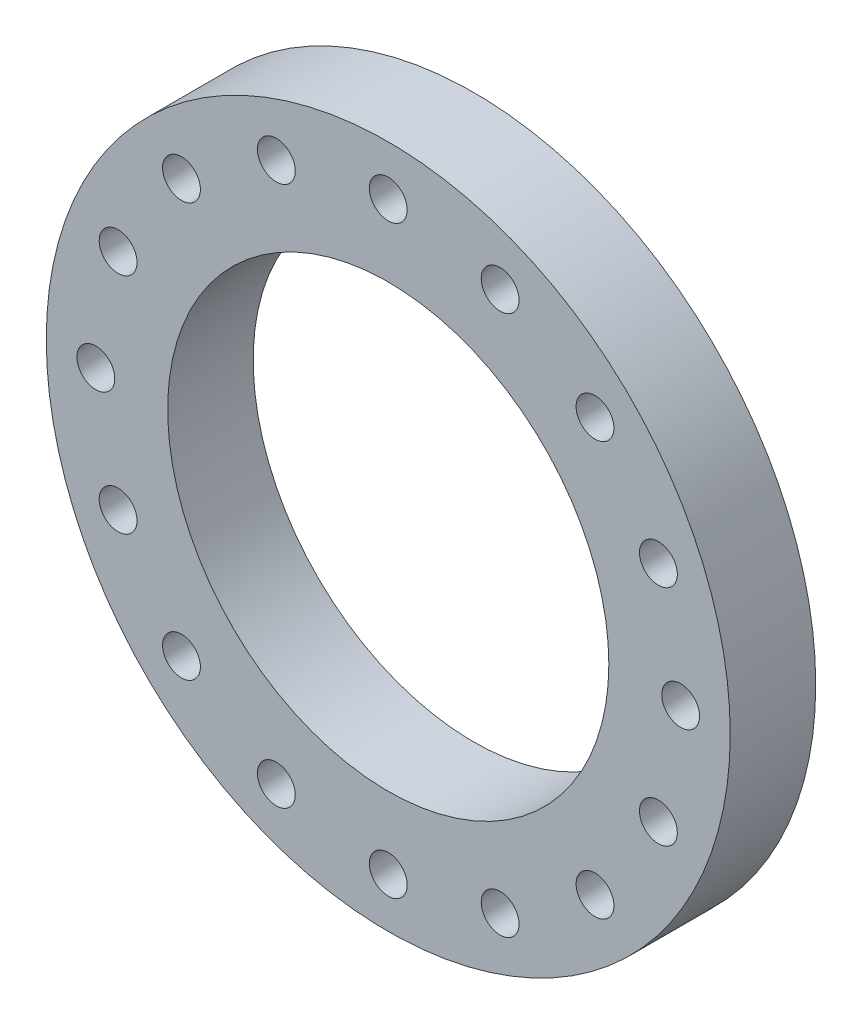
ISO-10303-21;
HEADER;
FILE_DESCRIPTION(('STEP AP214'),'2;1');
FILE_NAME('part.step','',(''),(''),'','','');
FILE_SCHEMA(('AUTOMOTIVE_DESIGN { 1 0 10303 214 1 1 1 1 }'));
ENDSEC;
DATA;
#1=APPLICATION_CONTEXT('core data for automotive mechanical design processes');
#2=APPLICATION_PROTOCOL_DEFINITION('international standard','automotive_design',2000,#1);
#3=PRODUCT_CONTEXT('',#1,'mechanical');
#4=PRODUCT('Part','Part','',(#3));
#5=PRODUCT_RELATED_PRODUCT_CATEGORY('part','',(#4));
#6=PRODUCT_DEFINITION_FORMATION('','',#4);
#7=PRODUCT_DEFINITION_CONTEXT('part definition',#1,'design');
#8=PRODUCT_DEFINITION('design','',#6,#7);
#9=PRODUCT_DEFINITION_SHAPE('','',#8);
#10=(LENGTH_UNIT() NAMED_UNIT(*) SI_UNIT(.MILLI.,.METRE.));
#11=(NAMED_UNIT(*) PLANE_ANGLE_UNIT() SI_UNIT($,.RADIAN.));
#12=(NAMED_UNIT(*) SI_UNIT($,.STERADIAN.) SOLID_ANGLE_UNIT());
#13=UNCERTAINTY_MEASURE_WITH_UNIT(LENGTH_MEASURE(1.E-05),#10,'distance_accuracy_value','');
#14=(GEOMETRIC_REPRESENTATION_CONTEXT(3) GLOBAL_UNCERTAINTY_ASSIGNED_CONTEXT((#13)) GLOBAL_UNIT_ASSIGNED_CONTEXT((#10,
#11,#12)) REPRESENTATION_CONTEXT('',''));
#15=CARTESIAN_POINT('',(0.,0.,0.));
#16=DIRECTION('',(0.,0.,1.));
#17=DIRECTION('',(1.,0.,0.));
#18=AXIS2_PLACEMENT_3D('',#15,#16,#17);
#19=CARTESIAN_POINT('',(0.,0.,19.05));
#20=DIRECTION('',(0.,0.,1.));
#21=DIRECTION('',(1.,0.,0.));
#22=AXIS2_PLACEMENT_3D('',#19,#20,#21);
#23=PLANE('',#22);
#24=CARTESIAN_POINT('',(46.0687139010842,46.0687139010853,19.05));
#25=DIRECTION('',(0.,0.,1.));
#26=DIRECTION('',(0.707106781186556,-0.707106781186539,0.));
#27=AXIS2_PLACEMENT_3D('',#24,#25,#26);
#28=CIRCLE('',#27,4.2164);
#29=CARTESIAN_POINT('',(49.0501589332792,43.0872688688904,19.05));
#30=VERTEX_POINT('',#29);
#31=EDGE_CURVE('E136',#30,#30,#28,.T.);
#32=ORIENTED_EDGE('',*,*,#31,.F.);
#33=EDGE_LOOP('',(#32));
#34=FACE_BOUND('',#33,.T.);
#35=CARTESIAN_POINT('',(65.151,6.82420502120907E-13,19.05));
#36=DIRECTION('',(0.,0.,1.));
#37=DIRECTION('',(0.,-1.,0.));
#38=AXIS2_PLACEMENT_3D('',#35,#36,#37);
#39=CIRCLE('',#38,4.2164);
#40=CARTESIAN_POINT('',(65.151,-4.21639999999932,19.05));
#41=VERTEX_POINT('',#40);
#42=EDGE_CURVE('E124',#41,#41,#39,.T.);
#43=ORIENTED_EDGE('',*,*,#42,.F.);
#44=EDGE_LOOP('',(#43));
#45=FACE_BOUND('',#44,.T.);
#46=CARTESIAN_POINT('',(46.0687139010852,-46.0687139010844,19.05));
#47=DIRECTION('',(0.,0.,1.));
#48=DIRECTION('',(-0.707106781186541,-0.707106781186554,0.));
#49=AXIS2_PLACEMENT_3D('',#46,#47,#48);
#50=CIRCLE('',#49,4.2164);
#51=CARTESIAN_POINT('',(43.0872688688902,-49.0501589332793,19.05));
#52=VERTEX_POINT('',#51);
#53=EDGE_CURVE('E112',#52,#52,#50,.T.);
#54=ORIENTED_EDGE('',*,*,#53,.F.);
#55=EDGE_LOOP('',(#54));
#56=FACE_BOUND('',#55,.T.);
#57=CARTESIAN_POINT('',(4.54947001413938E-13,-65.151,19.05));
#58=DIRECTION('',(0.,0.,1.));
#59=DIRECTION('',(-1.,0.,0.));
#60=AXIS2_PLACEMENT_3D('',#57,#58,#59);
#61=CIRCLE('',#60,4.2164);
#62=CARTESIAN_POINT('',(-4.21639999999955,-65.151,19.05));
#63=VERTEX_POINT('',#62);
#64=EDGE_CURVE('E100',#63,#63,#61,.T.);
#65=ORIENTED_EDGE('',*,*,#64,.F.);
#66=EDGE_LOOP('',(#65));
#67=FACE_BOUND('',#66,.T.);
#68=CARTESIAN_POINT('',(-46.0687139010845,-46.068713901085,19.05));
#69=DIRECTION('',(0.,0.,1.));
#70=DIRECTION('',(-0.707106781186551,0.707106781186544,0.));
#71=AXIS2_PLACEMENT_3D('',#68,#69,#70);
#72=CIRCLE('',#71,4.2164);
#73=CARTESIAN_POINT('',(-49.0501589332795,-43.0872688688901,19.05));
#74=VERTEX_POINT('',#73);
#75=EDGE_CURVE('E88',#74,#74,#72,.T.);
#76=ORIENTED_EDGE('',*,*,#75,.F.);
#77=EDGE_LOOP('',(#76));
#78=FACE_BOUND('',#77,.T.);
#79=CARTESIAN_POINT('',(-65.151,-2.27473500706969E-13,19.05));
#80=DIRECTION('',(0.,0.,1.));
#81=DIRECTION('',(0.,1.,0.));
#82=AXIS2_PLACEMENT_3D('',#79,#80,#81);
#83=CIRCLE('',#82,4.2164);
#84=CARTESIAN_POINT('',(-65.151,4.21639999999977,19.05));
#85=VERTEX_POINT('',#84);
#86=EDGE_CURVE('E76',#85,#85,#83,.T.);
#87=ORIENTED_EDGE('',*,*,#86,.F.);
#88=EDGE_LOOP('',(#87));
#89=FACE_BOUND('',#88,.T.);
#90=CARTESIAN_POINT('',(-46.0687139010848,46.0687139010847,19.05));
#91=DIRECTION('',(0.,0.,1.));
#92=DIRECTION('',(0.707106781186546,0.707106781186549,0.));
#93=AXIS2_PLACEMENT_3D('',#90,#91,#92);
#94=CIRCLE('',#93,4.2164);
#95=CARTESIAN_POINT('',(-43.0872688688899,49.0501589332796,19.05));
#96=VERTEX_POINT('',#95);
#97=EDGE_CURVE('E64',#96,#96,#94,.T.);
#98=ORIENTED_EDGE('',*,*,#97,.F.);
#99=EDGE_LOOP('',(#98));
#100=FACE_BOUND('',#99,.T.);
#101=CARTESIAN_POINT('',(0.,65.151,19.05));
#102=DIRECTION('',(0.,0.,1.));
#103=DIRECTION('',(1.,0.,0.));
#104=AXIS2_PLACEMENT_3D('',#101,#102,#103);
#105=CIRCLE('',#104,4.2164);
#106=CARTESIAN_POINT('',(4.2164,65.151,19.05));
#107=VERTEX_POINT('',#106);
#108=EDGE_CURVE('E52',#107,#107,#105,.T.);
#109=ORIENTED_EDGE('',*,*,#108,.F.);
#110=EDGE_LOOP('',(#109));
#111=FACE_BOUND('',#110,.T.);
#112=CARTESIAN_POINT('',(0.,0.,19.05));
#113=DIRECTION('',(0.,0.,1.));
#114=DIRECTION('',(1.,0.,0.));
#115=AXIS2_PLACEMENT_3D('',#112,#113,#114);
#116=CIRCLE('',#115,76.2);
#117=CARTESIAN_POINT('',(76.2,0.,19.05));
#118=VERTEX_POINT('',#117);
#119=EDGE_CURVE('E11',#118,#118,#116,.T.);
#120=ORIENTED_EDGE('',*,*,#119,.T.);
#121=EDGE_LOOP('',(#120));
#122=FACE_BOUND('',#121,.T.);
#123=CARTESIAN_POINT('',(0.,0.,19.05));
#124=DIRECTION('',(0.,0.,1.));
#125=DIRECTION('',(1.,0.,0.));
#126=AXIS2_PLACEMENT_3D('',#123,#124,#125);
#127=CIRCLE('',#126,49.149);
#128=CARTESIAN_POINT('',(49.149,0.,19.05));
#129=VERTEX_POINT('',#128);
#130=EDGE_CURVE('E47',#129,#129,#127,.T.);
#131=ORIENTED_EDGE('',*,*,#130,.F.);
#132=EDGE_LOOP('',(#131));
#133=FACE_BOUND('',#132,.T.);
#134=CARTESIAN_POINT('',(-24.932208302018,60.1916754226428,19.05));
#135=DIRECTION('',(0.,0.,1.));
#136=DIRECTION('',(0.923879532511287,0.382683432365091,0.));
#137=AXIS2_PLACEMENT_3D('',#134,#135,#136);
#138=CIRCLE('',#137,4.2164);
#139=CARTESIAN_POINT('',(-21.0367626411374,61.805221846867,19.05));
#140=VERTEX_POINT('',#139);
#141=EDGE_CURVE('E58',#140,#140,#138,.T.);
#142=ORIENTED_EDGE('',*,*,#141,.F.);
#143=EDGE_LOOP('',(#142));
#144=FACE_BOUND('',#143,.T.);
#145=CARTESIAN_POINT('',(-60.1916754226429,24.9322083020178,19.05));
#146=DIRECTION('',(0.,0.,1.));
#147=DIRECTION('',(0.382683432365087,0.923879532511288,0.));
#148=AXIS2_PLACEMENT_3D('',#145,#146,#147);
#149=CIRCLE('',#148,4.2164);
#150=CARTESIAN_POINT('',(-58.5781289984187,28.8276539628984,19.05));
#151=VERTEX_POINT('',#150);
#152=EDGE_CURVE('E70',#151,#151,#149,.T.);
#153=ORIENTED_EDGE('',*,*,#152,.F.);
#154=EDGE_LOOP('',(#153));
#155=FACE_BOUND('',#154,.T.);
#156=CARTESIAN_POINT('',(-60.1916754226427,-24.9322083020182,19.05));
#157=DIRECTION('',(0.,0.,1.));
#158=DIRECTION('',(-0.382683432365094,0.923879532511285,0.));
#159=AXIS2_PLACEMENT_3D('',#156,#157,#158);
#160=CIRCLE('',#159,4.2164);
#161=CARTESIAN_POINT('',(-61.8052218468669,-21.0367626411376,19.05));
#162=VERTEX_POINT('',#161);
#163=EDGE_CURVE('E82',#162,#162,#160,.T.);
#164=ORIENTED_EDGE('',*,*,#163,.F.);
#165=EDGE_LOOP('',(#164));
#166=FACE_BOUND('',#165,.T.);
#167=CARTESIAN_POINT('',(-24.9322083020176,-60.191675422643,19.05));
#168=DIRECTION('',(0.,0.,1.));
#169=DIRECTION('',(-0.923879532511289,0.382683432365084,0.));
#170=AXIS2_PLACEMENT_3D('',#167,#168,#169);
#171=CIRCLE('',#170,4.2164);
#172=CARTESIAN_POINT('',(-28.8276539628982,-58.5781289984189,19.05));
#173=VERTEX_POINT('',#172);
#174=EDGE_CURVE('E94',#173,#173,#171,.T.);
#175=ORIENTED_EDGE('',*,*,#174,.F.);
#176=EDGE_LOOP('',(#175));
#177=FACE_BOUND('',#176,.T.);
#178=CARTESIAN_POINT('',(24.9322083020184,-60.1916754226427,19.05));
#179=DIRECTION('',(0.,0.,1.));
#180=DIRECTION('',(-0.923879532511284,-0.382683432365097,0.));
#181=AXIS2_PLACEMENT_3D('',#178,#179,#180);
#182=CIRCLE('',#181,4.2164);
#183=CARTESIAN_POINT('',(21.0367626411379,-61.8052218468668,19.05));
#184=VERTEX_POINT('',#183);
#185=EDGE_CURVE('E106',#184,#184,#182,.T.);
#186=ORIENTED_EDGE('',*,*,#185,.F.);
#187=EDGE_LOOP('',(#186));
#188=FACE_BOUND('',#187,.T.);
#189=CARTESIAN_POINT('',(60.1916754226431,-24.9322083020174,19.05));
#190=DIRECTION('',(0.,0.,1.));
#191=DIRECTION('',(-0.382683432365081,-0.923879532511291,0.));
#192=AXIS2_PLACEMENT_3D('',#189,#190,#191);
#193=CIRCLE('',#192,4.2164);
#194=CARTESIAN_POINT('',(58.578128998419,-28.827653962898,19.05));
#195=VERTEX_POINT('',#194);
#196=EDGE_CURVE('E118',#195,#195,#193,.T.);
#197=ORIENTED_EDGE('',*,*,#196,.F.);
#198=EDGE_LOOP('',(#197));
#199=FACE_BOUND('',#198,.T.);
#200=CARTESIAN_POINT('',(60.1916754226426,24.9322083020186,19.05));
#201=DIRECTION('',(0.,0.,1.));
#202=DIRECTION('',(0.3826834323651,-0.923879532511283,0.));
#203=AXIS2_PLACEMENT_3D('',#200,#201,#202);
#204=CIRCLE('',#203,4.2164);
#205=CARTESIAN_POINT('',(61.8052218468668,21.036762641138,19.05));
#206=VERTEX_POINT('',#205);
#207=EDGE_CURVE('E130',#206,#206,#204,.T.);
#208=ORIENTED_EDGE('',*,*,#207,.F.);
#209=EDGE_LOOP('',(#208));
#210=FACE_BOUND('',#209,.T.);
#211=CARTESIAN_POINT('',(24.9322083020172,60.1916754226432,19.05));
#212=DIRECTION('',(0.,0.,1.));
#213=DIRECTION('',(0.923879532511292,-0.382683432365077,0.));
#214=AXIS2_PLACEMENT_3D('',#211,#212,#213);
#215=CIRCLE('',#214,4.2164);
#216=CARTESIAN_POINT('',(28.8276539628978,58.5781289984191,19.05));
#217=VERTEX_POINT('',#216);
#218=EDGE_CURVE('E142',#217,#217,#215,.T.);
#219=ORIENTED_EDGE('',*,*,#218,.F.);
#220=EDGE_LOOP('',(#219));
#221=FACE_BOUND('',#220,.T.);
#222=ADVANCED_FACE('F36',(#34,#45,#56,#67,#78,#89,#100,#111,#122,#133,#144,#155,#166,#177,#188,
#199,#210,#221),#23,.T.);
#223=CARTESIAN_POINT('',(0.,0.,0.));
#224=DIRECTION('',(0.,0.,1.));
#225=DIRECTION('',(1.,0.,0.));
#226=AXIS2_PLACEMENT_3D('',#223,#224,#225);
#227=PLANE('',#226);
#228=CARTESIAN_POINT('',(46.0687139010842,46.0687139010853,0.));
#229=DIRECTION('',(0.,0.,1.));
#230=DIRECTION('',(0.707106781186556,-0.707106781186539,0.));
#231=AXIS2_PLACEMENT_3D('',#228,#229,#230);
#232=CIRCLE('',#231,4.2164);
#233=CARTESIAN_POINT('',(49.0501589332792,43.0872688688904,0.));
#234=VERTEX_POINT('',#233);
#235=EDGE_CURVE('E139',#234,#234,#232,.T.);
#236=ORIENTED_EDGE('',*,*,#235,.T.);
#237=EDGE_LOOP('',(#236));
#238=FACE_BOUND('',#237,.T.);
#239=CARTESIAN_POINT('',(65.151,6.82420502120907E-13,0.));
#240=DIRECTION('',(0.,0.,1.));
#241=DIRECTION('',(0.,-1.,0.));
#242=AXIS2_PLACEMENT_3D('',#239,#240,#241);
#243=CIRCLE('',#242,4.2164);
#244=CARTESIAN_POINT('',(65.151,-4.21639999999932,0.));
#245=VERTEX_POINT('',#244);
#246=EDGE_CURVE('E127',#245,#245,#243,.T.);
#247=ORIENTED_EDGE('',*,*,#246,.T.);
#248=EDGE_LOOP('',(#247));
#249=FACE_BOUND('',#248,.T.);
#250=CARTESIAN_POINT('',(46.0687139010852,-46.0687139010844,0.));
#251=DIRECTION('',(0.,0.,1.));
#252=DIRECTION('',(-0.707106781186541,-0.707106781186554,0.));
#253=AXIS2_PLACEMENT_3D('',#250,#251,#252);
#254=CIRCLE('',#253,4.2164);
#255=CARTESIAN_POINT('',(43.0872688688902,-49.0501589332793,0.));
#256=VERTEX_POINT('',#255);
#257=EDGE_CURVE('E115',#256,#256,#254,.T.);
#258=ORIENTED_EDGE('',*,*,#257,.T.);
#259=EDGE_LOOP('',(#258));
#260=FACE_BOUND('',#259,.T.);
#261=CARTESIAN_POINT('',(4.54947001413938E-13,-65.151,0.));
#262=DIRECTION('',(0.,0.,1.));
#263=DIRECTION('',(-1.,0.,0.));
#264=AXIS2_PLACEMENT_3D('',#261,#262,#263);
#265=CIRCLE('',#264,4.2164);
#266=CARTESIAN_POINT('',(-4.21639999999955,-65.151,0.));
#267=VERTEX_POINT('',#266);
#268=EDGE_CURVE('E103',#267,#267,#265,.T.);
#269=ORIENTED_EDGE('',*,*,#268,.T.);
#270=EDGE_LOOP('',(#269));
#271=FACE_BOUND('',#270,.T.);
#272=CARTESIAN_POINT('',(-46.0687139010845,-46.068713901085,0.));
#273=DIRECTION('',(0.,0.,1.));
#274=DIRECTION('',(-0.707106781186551,0.707106781186544,0.));
#275=AXIS2_PLACEMENT_3D('',#272,#273,#274);
#276=CIRCLE('',#275,4.2164);
#277=CARTESIAN_POINT('',(-49.0501589332795,-43.0872688688901,0.));
#278=VERTEX_POINT('',#277);
#279=EDGE_CURVE('E91',#278,#278,#276,.T.);
#280=ORIENTED_EDGE('',*,*,#279,.T.);
#281=EDGE_LOOP('',(#280));
#282=FACE_BOUND('',#281,.T.);
#283=CARTESIAN_POINT('',(-65.151,-2.27473500706969E-13,0.));
#284=DIRECTION('',(0.,0.,1.));
#285=DIRECTION('',(0.,1.,0.));
#286=AXIS2_PLACEMENT_3D('',#283,#284,#285);
#287=CIRCLE('',#286,4.2164);
#288=CARTESIAN_POINT('',(-65.151,4.21639999999977,0.));
#289=VERTEX_POINT('',#288);
#290=EDGE_CURVE('E79',#289,#289,#287,.T.);
#291=ORIENTED_EDGE('',*,*,#290,.T.);
#292=EDGE_LOOP('',(#291));
#293=FACE_BOUND('',#292,.T.);
#294=CARTESIAN_POINT('',(-46.0687139010848,46.0687139010847,0.));
#295=DIRECTION('',(0.,0.,1.));
#296=DIRECTION('',(0.707106781186546,0.707106781186549,0.));
#297=AXIS2_PLACEMENT_3D('',#294,#295,#296);
#298=CIRCLE('',#297,4.2164);
#299=CARTESIAN_POINT('',(-43.0872688688899,49.0501589332796,0.));
#300=VERTEX_POINT('',#299);
#301=EDGE_CURVE('E67',#300,#300,#298,.T.);
#302=ORIENTED_EDGE('',*,*,#301,.T.);
#303=EDGE_LOOP('',(#302));
#304=FACE_BOUND('',#303,.T.);
#305=CARTESIAN_POINT('',(0.,65.151,0.));
#306=DIRECTION('',(0.,0.,1.));
#307=DIRECTION('',(1.,0.,0.));
#308=AXIS2_PLACEMENT_3D('',#305,#306,#307);
#309=CIRCLE('',#308,4.2164);
#310=CARTESIAN_POINT('',(4.2164,65.151,0.));
#311=VERTEX_POINT('',#310);
#312=EDGE_CURVE('E55',#311,#311,#309,.T.);
#313=ORIENTED_EDGE('',*,*,#312,.T.);
#314=EDGE_LOOP('',(#313));
#315=FACE_BOUND('',#314,.T.);
#316=CARTESIAN_POINT('',(0.,0.,0.));
#317=DIRECTION('',(0.,0.,1.));
#318=DIRECTION('',(1.,0.,0.));
#319=AXIS2_PLACEMENT_3D('',#316,#317,#318);
#320=CIRCLE('',#319,76.2);
#321=CARTESIAN_POINT('',(76.2,0.,0.));
#322=VERTEX_POINT('',#321);
#323=EDGE_CURVE('E40',#322,#322,#320,.T.);
#324=ORIENTED_EDGE('',*,*,#323,.F.);
#325=EDGE_LOOP('',(#324));
#326=FACE_BOUND('',#325,.T.);
#327=CARTESIAN_POINT('',(0.,0.,0.));
#328=DIRECTION('',(0.,0.,1.));
#329=DIRECTION('',(1.,0.,0.));
#330=AXIS2_PLACEMENT_3D('',#327,#328,#329);
#331=CIRCLE('',#330,49.149);
#332=CARTESIAN_POINT('',(49.149,0.,0.));
#333=VERTEX_POINT('',#332);
#334=EDGE_CURVE('E49',#333,#333,#331,.T.);
#335=ORIENTED_EDGE('',*,*,#334,.T.);
#336=EDGE_LOOP('',(#335));
#337=FACE_BOUND('',#336,.T.);
#338=CARTESIAN_POINT('',(-24.932208302018,60.1916754226428,0.));
#339=DIRECTION('',(0.,0.,1.));
#340=DIRECTION('',(0.923879532511287,0.382683432365091,0.));
#341=AXIS2_PLACEMENT_3D('',#338,#339,#340);
#342=CIRCLE('',#341,4.2164);
#343=CARTESIAN_POINT('',(-21.0367626411374,61.805221846867,0.));
#344=VERTEX_POINT('',#343);
#345=EDGE_CURVE('E61',#344,#344,#342,.T.);
#346=ORIENTED_EDGE('',*,*,#345,.T.);
#347=EDGE_LOOP('',(#346));
#348=FACE_BOUND('',#347,.T.);
#349=CARTESIAN_POINT('',(-60.1916754226429,24.9322083020178,0.));
#350=DIRECTION('',(0.,0.,1.));
#351=DIRECTION('',(0.382683432365087,0.923879532511288,0.));
#352=AXIS2_PLACEMENT_3D('',#349,#350,#351);
#353=CIRCLE('',#352,4.2164);
#354=CARTESIAN_POINT('',(-58.5781289984187,28.8276539628984,0.));
#355=VERTEX_POINT('',#354);
#356=EDGE_CURVE('E73',#355,#355,#353,.T.);
#357=ORIENTED_EDGE('',*,*,#356,.T.);
#358=EDGE_LOOP('',(#357));
#359=FACE_BOUND('',#358,.T.);
#360=CARTESIAN_POINT('',(-60.1916754226427,-24.9322083020182,0.));
#361=DIRECTION('',(0.,0.,1.));
#362=DIRECTION('',(-0.382683432365094,0.923879532511285,0.));
#363=AXIS2_PLACEMENT_3D('',#360,#361,#362);
#364=CIRCLE('',#363,4.2164);
#365=CARTESIAN_POINT('',(-61.8052218468669,-21.0367626411376,0.));
#366=VERTEX_POINT('',#365);
#367=EDGE_CURVE('E85',#366,#366,#364,.T.);
#368=ORIENTED_EDGE('',*,*,#367,.T.);
#369=EDGE_LOOP('',(#368));
#370=FACE_BOUND('',#369,.T.);
#371=CARTESIAN_POINT('',(-24.9322083020176,-60.191675422643,0.));
#372=DIRECTION('',(0.,0.,1.));
#373=DIRECTION('',(-0.923879532511289,0.382683432365084,0.));
#374=AXIS2_PLACEMENT_3D('',#371,#372,#373);
#375=CIRCLE('',#374,4.2164);
#376=CARTESIAN_POINT('',(-28.8276539628982,-58.5781289984189,0.));
#377=VERTEX_POINT('',#376);
#378=EDGE_CURVE('E97',#377,#377,#375,.T.);
#379=ORIENTED_EDGE('',*,*,#378,.T.);
#380=EDGE_LOOP('',(#379));
#381=FACE_BOUND('',#380,.T.);
#382=CARTESIAN_POINT('',(24.9322083020184,-60.1916754226427,0.));
#383=DIRECTION('',(0.,0.,1.));
#384=DIRECTION('',(-0.923879532511284,-0.382683432365097,0.));
#385=AXIS2_PLACEMENT_3D('',#382,#383,#384);
#386=CIRCLE('',#385,4.2164);
#387=CARTESIAN_POINT('',(21.0367626411379,-61.8052218468668,0.));
#388=VERTEX_POINT('',#387);
#389=EDGE_CURVE('E109',#388,#388,#386,.T.);
#390=ORIENTED_EDGE('',*,*,#389,.T.);
#391=EDGE_LOOP('',(#390));
#392=FACE_BOUND('',#391,.T.);
#393=CARTESIAN_POINT('',(60.1916754226431,-24.9322083020174,0.));
#394=DIRECTION('',(0.,0.,1.));
#395=DIRECTION('',(-0.382683432365081,-0.923879532511291,0.));
#396=AXIS2_PLACEMENT_3D('',#393,#394,#395);
#397=CIRCLE('',#396,4.2164);
#398=CARTESIAN_POINT('',(58.578128998419,-28.827653962898,0.));
#399=VERTEX_POINT('',#398);
#400=EDGE_CURVE('E121',#399,#399,#397,.T.);
#401=ORIENTED_EDGE('',*,*,#400,.T.);
#402=EDGE_LOOP('',(#401));
#403=FACE_BOUND('',#402,.T.);
#404=CARTESIAN_POINT('',(60.1916754226426,24.9322083020186,0.));
#405=DIRECTION('',(0.,0.,1.));
#406=DIRECTION('',(0.3826834323651,-0.923879532511283,0.));
#407=AXIS2_PLACEMENT_3D('',#404,#405,#406);
#408=CIRCLE('',#407,4.2164);
#409=CARTESIAN_POINT('',(61.8052218468668,21.036762641138,0.));
#410=VERTEX_POINT('',#409);
#411=EDGE_CURVE('E133',#410,#410,#408,.T.);
#412=ORIENTED_EDGE('',*,*,#411,.T.);
#413=EDGE_LOOP('',(#412));
#414=FACE_BOUND('',#413,.T.);
#415=CARTESIAN_POINT('',(24.9322083020172,60.1916754226432,0.));
#416=DIRECTION('',(0.,0.,1.));
#417=DIRECTION('',(0.923879532511292,-0.382683432365077,0.));
#418=AXIS2_PLACEMENT_3D('',#415,#416,#417);
#419=CIRCLE('',#418,4.2164);
#420=CARTESIAN_POINT('',(28.8276539628978,58.5781289984191,0.));
#421=VERTEX_POINT('',#420);
#422=EDGE_CURVE('E145',#421,#421,#419,.T.);
#423=ORIENTED_EDGE('',*,*,#422,.T.);
#424=EDGE_LOOP('',(#423));
#425=FACE_BOUND('',#424,.T.);
#426=ADVANCED_FACE('F155',(#238,#249,#260,#271,#282,#293,#304,#315,#326,#337,#348,#359,#370,
#381,#392,#403,#414,#425),#227,.F.);
#427=CARTESIAN_POINT('',(0.,0.,19.05));
#428=DIRECTION('',(0.,0.,-1.));
#429=DIRECTION('',(-1.,0.,0.));
#430=AXIS2_PLACEMENT_3D('',#427,#428,#429);
#431=CYLINDRICAL_SURFACE('',#430,76.2);
#432=ORIENTED_EDGE('',*,*,#119,.F.);
#433=EDGE_LOOP('',(#432));
#434=FACE_BOUND('',#433,.T.);
#435=ORIENTED_EDGE('',*,*,#323,.T.);
#436=EDGE_LOOP('',(#435));
#437=FACE_BOUND('',#436,.T.);
#438=ADVANCED_FACE('F38',(#434,#437),#431,.T.);
#439=CARTESIAN_POINT('',(0.,0.,19.05));
#440=DIRECTION('',(0.,0.,-1.));
#441=DIRECTION('',(-1.,0.,0.));
#442=AXIS2_PLACEMENT_3D('',#439,#440,#441);
#443=CYLINDRICAL_SURFACE('',#442,49.149);
#444=ORIENTED_EDGE('',*,*,#130,.T.);
#445=EDGE_LOOP('',(#444));
#446=FACE_BOUND('',#445,.T.);
#447=ORIENTED_EDGE('',*,*,#334,.F.);
#448=EDGE_LOOP('',(#447));
#449=FACE_BOUND('',#448,.T.);
#450=ADVANCED_FACE('F165',(#446,#449),#443,.F.);
#451=CARTESIAN_POINT('',(0.,65.151,19.05));
#452=DIRECTION('',(0.,0.,-1.));
#453=DIRECTION('',(-1.,0.,0.));
#454=AXIS2_PLACEMENT_3D('',#451,#452,#453);
#455=CYLINDRICAL_SURFACE('',#454,4.2164);
#456=ORIENTED_EDGE('',*,*,#108,.T.);
#457=EDGE_LOOP('',(#456));
#458=FACE_BOUND('',#457,.T.);
#459=ORIENTED_EDGE('',*,*,#312,.F.);
#460=EDGE_LOOP('',(#459));
#461=FACE_BOUND('',#460,.T.);
#462=ADVANCED_FACE('F168',(#458,#461),#455,.F.);
#463=CARTESIAN_POINT('',(-24.932208302018,60.1916754226428,19.05));
#464=DIRECTION('',(0.,0.,-1.));
#465=DIRECTION('',(-1.,0.,0.));
#466=AXIS2_PLACEMENT_3D('',#463,#464,#465);
#467=CYLINDRICAL_SURFACE('',#466,4.2164);
#468=ORIENTED_EDGE('',*,*,#141,.T.);
#469=EDGE_LOOP('',(#468));
#470=FACE_BOUND('',#469,.T.);
#471=ORIENTED_EDGE('',*,*,#345,.F.);
#472=EDGE_LOOP('',(#471));
#473=FACE_BOUND('',#472,.T.);
#474=ADVANCED_FACE('F172',(#470,#473),#467,.F.);
#475=CARTESIAN_POINT('',(-46.0687139010848,46.0687139010847,19.05));
#476=DIRECTION('',(0.,0.,-1.));
#477=DIRECTION('',(-1.,0.,0.));
#478=AXIS2_PLACEMENT_3D('',#475,#476,#477);
#479=CYLINDRICAL_SURFACE('',#478,4.2164);
#480=ORIENTED_EDGE('',*,*,#97,.T.);
#481=EDGE_LOOP('',(#480));
#482=FACE_BOUND('',#481,.T.);
#483=ORIENTED_EDGE('',*,*,#301,.F.);
#484=EDGE_LOOP('',(#483));
#485=FACE_BOUND('',#484,.T.);
#486=ADVANCED_FACE('F176',(#482,#485),#479,.F.);
#487=CARTESIAN_POINT('',(-60.1916754226429,24.9322083020178,19.05));
#488=DIRECTION('',(0.,0.,-1.));
#489=DIRECTION('',(-1.,0.,0.));
#490=AXIS2_PLACEMENT_3D('',#487,#488,#489);
#491=CYLINDRICAL_SURFACE('',#490,4.2164);
#492=ORIENTED_EDGE('',*,*,#152,.T.);
#493=EDGE_LOOP('',(#492));
#494=FACE_BOUND('',#493,.T.);
#495=ORIENTED_EDGE('',*,*,#356,.F.);
#496=EDGE_LOOP('',(#495));
#497=FACE_BOUND('',#496,.T.);
#498=ADVANCED_FACE('F180',(#494,#497),#491,.F.);
#499=CARTESIAN_POINT('',(-65.151,-2.27473500706969E-13,19.05));
#500=DIRECTION('',(0.,0.,-1.));
#501=DIRECTION('',(-1.,0.,0.));
#502=AXIS2_PLACEMENT_3D('',#499,#500,#501);
#503=CYLINDRICAL_SURFACE('',#502,4.2164);
#504=ORIENTED_EDGE('',*,*,#86,.T.);
#505=EDGE_LOOP('',(#504));
#506=FACE_BOUND('',#505,.T.);
#507=ORIENTED_EDGE('',*,*,#290,.F.);
#508=EDGE_LOOP('',(#507));
#509=FACE_BOUND('',#508,.T.);
#510=ADVANCED_FACE('F184',(#506,#509),#503,.F.);
#511=CARTESIAN_POINT('',(-60.1916754226427,-24.9322083020182,19.05));
#512=DIRECTION('',(0.,0.,-1.));
#513=DIRECTION('',(-1.,0.,0.));
#514=AXIS2_PLACEMENT_3D('',#511,#512,#513);
#515=CYLINDRICAL_SURFACE('',#514,4.2164);
#516=ORIENTED_EDGE('',*,*,#163,.T.);
#517=EDGE_LOOP('',(#516));
#518=FACE_BOUND('',#517,.T.);
#519=ORIENTED_EDGE('',*,*,#367,.F.);
#520=EDGE_LOOP('',(#519));
#521=FACE_BOUND('',#520,.T.);
#522=ADVANCED_FACE('F188',(#518,#521),#515,.F.);
#523=CARTESIAN_POINT('',(-46.0687139010845,-46.068713901085,19.05));
#524=DIRECTION('',(0.,0.,-1.));
#525=DIRECTION('',(-1.,0.,0.));
#526=AXIS2_PLACEMENT_3D('',#523,#524,#525);
#527=CYLINDRICAL_SURFACE('',#526,4.2164);
#528=ORIENTED_EDGE('',*,*,#75,.T.);
#529=EDGE_LOOP('',(#528));
#530=FACE_BOUND('',#529,.T.);
#531=ORIENTED_EDGE('',*,*,#279,.F.);
#532=EDGE_LOOP('',(#531));
#533=FACE_BOUND('',#532,.T.);
#534=ADVANCED_FACE('F192',(#530,#533),#527,.F.);
#535=CARTESIAN_POINT('',(-24.9322083020176,-60.191675422643,19.05));
#536=DIRECTION('',(0.,0.,-1.));
#537=DIRECTION('',(-1.,0.,0.));
#538=AXIS2_PLACEMENT_3D('',#535,#536,#537);
#539=CYLINDRICAL_SURFACE('',#538,4.2164);
#540=ORIENTED_EDGE('',*,*,#174,.T.);
#541=EDGE_LOOP('',(#540));
#542=FACE_BOUND('',#541,.T.);
#543=ORIENTED_EDGE('',*,*,#378,.F.);
#544=EDGE_LOOP('',(#543));
#545=FACE_BOUND('',#544,.T.);
#546=ADVANCED_FACE('F196',(#542,#545),#539,.F.);
#547=CARTESIAN_POINT('',(4.54947001413938E-13,-65.151,19.05));
#548=DIRECTION('',(0.,0.,-1.));
#549=DIRECTION('',(-1.,0.,0.));
#550=AXIS2_PLACEMENT_3D('',#547,#548,#549);
#551=CYLINDRICAL_SURFACE('',#550,4.2164);
#552=ORIENTED_EDGE('',*,*,#64,.T.);
#553=EDGE_LOOP('',(#552));
#554=FACE_BOUND('',#553,.T.);
#555=ORIENTED_EDGE('',*,*,#268,.F.);
#556=EDGE_LOOP('',(#555));
#557=FACE_BOUND('',#556,.T.);
#558=ADVANCED_FACE('F200',(#554,#557),#551,.F.);
#559=CARTESIAN_POINT('',(24.9322083020184,-60.1916754226427,19.05));
#560=DIRECTION('',(0.,0.,-1.));
#561=DIRECTION('',(-1.,0.,0.));
#562=AXIS2_PLACEMENT_3D('',#559,#560,#561);
#563=CYLINDRICAL_SURFACE('',#562,4.2164);
#564=ORIENTED_EDGE('',*,*,#185,.T.);
#565=EDGE_LOOP('',(#564));
#566=FACE_BOUND('',#565,.T.);
#567=ORIENTED_EDGE('',*,*,#389,.F.);
#568=EDGE_LOOP('',(#567));
#569=FACE_BOUND('',#568,.T.);
#570=ADVANCED_FACE('F204',(#566,#569),#563,.F.);
#571=CARTESIAN_POINT('',(46.0687139010852,-46.0687139010844,19.05));
#572=DIRECTION('',(0.,0.,-1.));
#573=DIRECTION('',(-1.,0.,0.));
#574=AXIS2_PLACEMENT_3D('',#571,#572,#573);
#575=CYLINDRICAL_SURFACE('',#574,4.2164);
#576=ORIENTED_EDGE('',*,*,#53,.T.);
#577=EDGE_LOOP('',(#576));
#578=FACE_BOUND('',#577,.T.);
#579=ORIENTED_EDGE('',*,*,#257,.F.);
#580=EDGE_LOOP('',(#579));
#581=FACE_BOUND('',#580,.T.);
#582=ADVANCED_FACE('F208',(#578,#581),#575,.F.);
#583=CARTESIAN_POINT('',(60.1916754226431,-24.9322083020174,19.05));
#584=DIRECTION('',(0.,0.,-1.));
#585=DIRECTION('',(-1.,0.,0.));
#586=AXIS2_PLACEMENT_3D('',#583,#584,#585);
#587=CYLINDRICAL_SURFACE('',#586,4.2164);
#588=ORIENTED_EDGE('',*,*,#196,.T.);
#589=EDGE_LOOP('',(#588));
#590=FACE_BOUND('',#589,.T.);
#591=ORIENTED_EDGE('',*,*,#400,.F.);
#592=EDGE_LOOP('',(#591));
#593=FACE_BOUND('',#592,.T.);
#594=ADVANCED_FACE('F212',(#590,#593),#587,.F.);
#595=CARTESIAN_POINT('',(65.151,6.82420502120907E-13,19.05));
#596=DIRECTION('',(0.,0.,-1.));
#597=DIRECTION('',(-1.,0.,0.));
#598=AXIS2_PLACEMENT_3D('',#595,#596,#597);
#599=CYLINDRICAL_SURFACE('',#598,4.2164);
#600=ORIENTED_EDGE('',*,*,#42,.T.);
#601=EDGE_LOOP('',(#600));
#602=FACE_BOUND('',#601,.T.);
#603=ORIENTED_EDGE('',*,*,#246,.F.);
#604=EDGE_LOOP('',(#603));
#605=FACE_BOUND('',#604,.T.);
#606=ADVANCED_FACE('F216',(#602,#605),#599,.F.);
#607=CARTESIAN_POINT('',(60.1916754226426,24.9322083020186,19.05));
#608=DIRECTION('',(0.,0.,-1.));
#609=DIRECTION('',(-1.,0.,0.));
#610=AXIS2_PLACEMENT_3D('',#607,#608,#609);
#611=CYLINDRICAL_SURFACE('',#610,4.2164);
#612=ORIENTED_EDGE('',*,*,#207,.T.);
#613=EDGE_LOOP('',(#612));
#614=FACE_BOUND('',#613,.T.);
#615=ORIENTED_EDGE('',*,*,#411,.F.);
#616=EDGE_LOOP('',(#615));
#617=FACE_BOUND('',#616,.T.);
#618=ADVANCED_FACE('F220',(#614,#617),#611,.F.);
#619=CARTESIAN_POINT('',(46.0687139010842,46.0687139010853,19.05));
#620=DIRECTION('',(0.,0.,-1.));
#621=DIRECTION('',(-1.,0.,0.));
#622=AXIS2_PLACEMENT_3D('',#619,#620,#621);
#623=CYLINDRICAL_SURFACE('',#622,4.2164);
#624=ORIENTED_EDGE('',*,*,#31,.T.);
#625=EDGE_LOOP('',(#624));
#626=FACE_BOUND('',#625,.T.);
#627=ORIENTED_EDGE('',*,*,#235,.F.);
#628=EDGE_LOOP('',(#627));
#629=FACE_BOUND('',#628,.T.);
#630=ADVANCED_FACE('F224',(#626,#629),#623,.F.);
#631=CARTESIAN_POINT('',(24.9322083020172,60.1916754226432,19.05));
#632=DIRECTION('',(0.,0.,-1.));
#633=DIRECTION('',(-1.,0.,0.));
#634=AXIS2_PLACEMENT_3D('',#631,#632,#633);
#635=CYLINDRICAL_SURFACE('',#634,4.2164);
#636=ORIENTED_EDGE('',*,*,#218,.T.);
#637=EDGE_LOOP('',(#636));
#638=FACE_BOUND('',#637,.T.);
#639=ORIENTED_EDGE('',*,*,#422,.F.);
#640=EDGE_LOOP('',(#639));
#641=FACE_BOUND('',#640,.T.);
#642=ADVANCED_FACE('F151',(#638,#641),#635,.F.);
#643=CLOSED_SHELL('',(#222,#426,#438,#450,#462,#474,#486,#498,#510,#522,#534,#546,#558,#570,
#582,#594,#606,#618,#630,#642));
#644=MANIFOLD_SOLID_BREP('B2',#643);
#645=ADVANCED_BREP_SHAPE_REPRESENTATION('',(#18,#644),#14);
#646=SHAPE_DEFINITION_REPRESENTATION(#9,#645);
ENDSEC;
END-ISO-10303-21;
